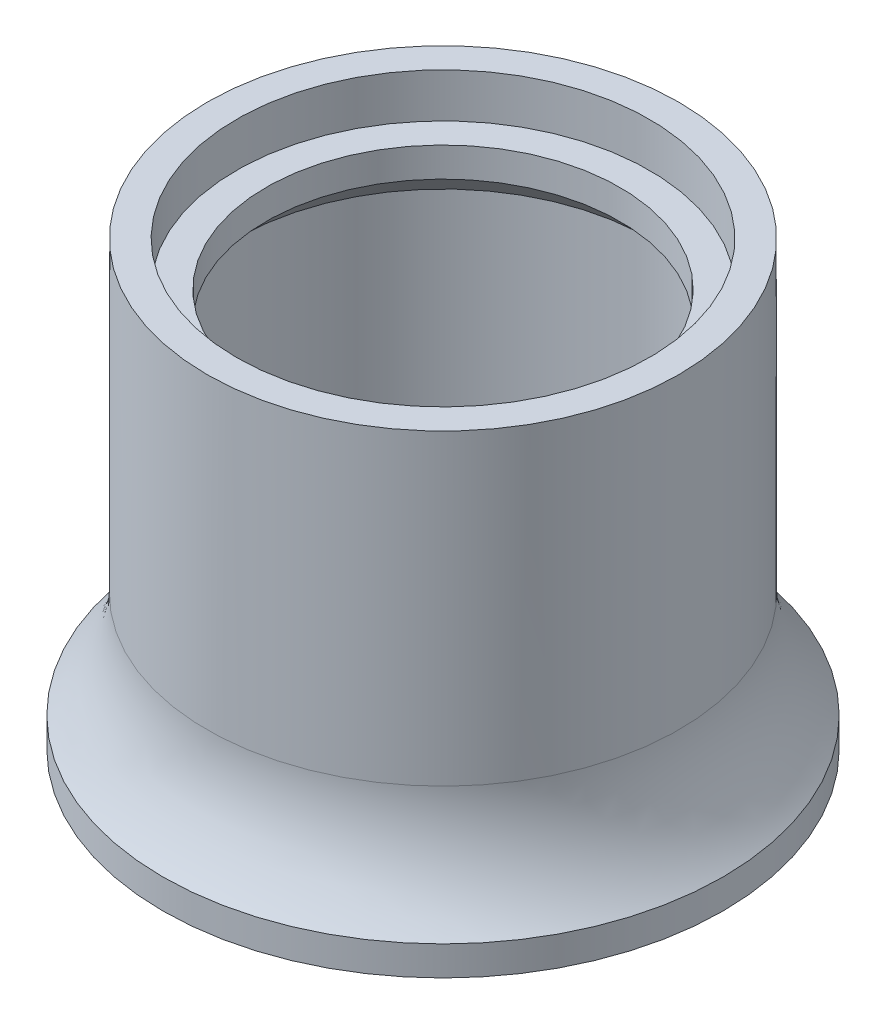
ISO-10303-21;
HEADER;
FILE_DESCRIPTION(('STEP AP214'),'2;1');
FILE_NAME('part.step','',(''),(''),'','','');
FILE_SCHEMA(('AUTOMOTIVE_DESIGN { 1 0 10303 214 1 1 1 1 }'));
ENDSEC;
DATA;
#1=APPLICATION_CONTEXT('core data for automotive mechanical design processes');
#2=APPLICATION_PROTOCOL_DEFINITION('international standard','automotive_design',2000,#1);
#3=PRODUCT_CONTEXT('',#1,'mechanical');
#4=PRODUCT('Part','Part','',(#3));
#5=PRODUCT_RELATED_PRODUCT_CATEGORY('part','',(#4));
#6=PRODUCT_DEFINITION_FORMATION('','',#4);
#7=PRODUCT_DEFINITION_CONTEXT('part definition',#1,'design');
#8=PRODUCT_DEFINITION('design','',#6,#7);
#9=PRODUCT_DEFINITION_SHAPE('','',#8);
#10=(LENGTH_UNIT() NAMED_UNIT(*) SI_UNIT(.MILLI.,.METRE.));
#11=(NAMED_UNIT(*) PLANE_ANGLE_UNIT() SI_UNIT($,.RADIAN.));
#12=(NAMED_UNIT(*) SI_UNIT($,.STERADIAN.) SOLID_ANGLE_UNIT());
#13=UNCERTAINTY_MEASURE_WITH_UNIT(LENGTH_MEASURE(1.E-05),#10,'distance_accuracy_value','');
#14=(GEOMETRIC_REPRESENTATION_CONTEXT(3) GLOBAL_UNCERTAINTY_ASSIGNED_CONTEXT((#13)) GLOBAL_UNIT_ASSIGNED_CONTEXT((#10,
#11,#12)) REPRESENTATION_CONTEXT('',''));
#15=CARTESIAN_POINT('',(0.,0.,0.));
#16=DIRECTION('',(0.,0.,1.));
#17=DIRECTION('',(1.,0.,0.));
#18=AXIS2_PLACEMENT_3D('',#15,#16,#17);
#19=CARTESIAN_POINT('',(0.,30.,0.));
#20=DIRECTION('',(0.,-1.,0.));
#21=DIRECTION('',(0.,0.,-1.));
#22=AXIS2_PLACEMENT_3D('',#19,#20,#21);
#23=CYLINDRICAL_SURFACE('',#22,16.);
#24=CARTESIAN_POINT('',(0.,9.14142842854285,0.));
#25=DIRECTION('',(0.,-1.,0.));
#26=DIRECTION('',(0.,0.,-1.));
#27=AXIS2_PLACEMENT_3D('',#24,#25,#26);
#28=CIRCLE('',#27,16.);
#29=CARTESIAN_POINT('',(0.,9.14142842854285,-16.));
#30=VERTEX_POINT('',#29);
#31=EDGE_CURVE('E10',#30,#30,#28,.F.);
#32=ORIENTED_EDGE('',*,*,#31,.T.);
#33=EDGE_LOOP('',(#32));
#34=FACE_BOUND('',#33,.T.);
#35=CARTESIAN_POINT('',(0.,30.,0.));
#36=DIRECTION('',(0.,1.,0.));
#37=DIRECTION('',(0.,0.,1.));
#38=AXIS2_PLACEMENT_3D('',#35,#36,#37);
#39=CIRCLE('',#38,16.);
#40=CARTESIAN_POINT('',(0.,30.,16.));
#41=VERTEX_POINT('',#40);
#42=EDGE_CURVE('E47',#41,#41,#39,.T.);
#43=ORIENTED_EDGE('',*,*,#42,.F.);
#44=EDGE_LOOP('',(#43));
#45=FACE_BOUND('',#44,.T.);
#46=ADVANCED_FACE('F32',(#34,#45),#23,.T.);
#47=CARTESIAN_POINT('',(0.,30.,0.));
#48=DIRECTION('',(0.,-1.,0.));
#49=DIRECTION('',(0.,0.,-1.));
#50=AXIS2_PLACEMENT_3D('',#47,#48,#49);
#51=CYLINDRICAL_SURFACE('',#50,14.);
#52=CARTESIAN_POINT('',(0.,23.,0.));
#53=DIRECTION('',(0.,1.,0.));
#54=DIRECTION('',(0.,0.,1.));
#55=AXIS2_PLACEMENT_3D('',#52,#53,#54);
#56=CIRCLE('',#55,14.);
#57=CARTESIAN_POINT('',(0.,23.,14.));
#58=VERTEX_POINT('',#57);
#59=EDGE_CURVE('E39',#58,#58,#56,.T.);
#60=ORIENTED_EDGE('',*,*,#59,.T.);
#61=EDGE_LOOP('',(#60));
#62=FACE_BOUND('',#61,.T.);
#63=CARTESIAN_POINT('',(0.,0.,0.));
#64=DIRECTION('',(0.,1.,0.));
#65=DIRECTION('',(0.,0.,1.));
#66=AXIS2_PLACEMENT_3D('',#63,#64,#65);
#67=CIRCLE('',#66,14.);
#68=CARTESIAN_POINT('',(0.,0.,14.));
#69=VERTEX_POINT('',#68);
#70=EDGE_CURVE('E53',#69,#69,#67,.T.);
#71=ORIENTED_EDGE('',*,*,#70,.F.);
#72=EDGE_LOOP('',(#71));
#73=FACE_BOUND('',#72,.T.);
#74=ADVANCED_FACE('F82',(#62,#73),#51,.F.);
#75=CARTESIAN_POINT('',(0.,30.,0.));
#76=DIRECTION('',(0.,1.,0.));
#77=DIRECTION('',(0.,0.,1.));
#78=AXIS2_PLACEMENT_3D('',#75,#76,#77);
#79=PLANE('',#78);
#80=ORIENTED_EDGE('',*,*,#42,.T.);
#81=EDGE_LOOP('',(#80));
#82=FACE_BOUND('',#81,.T.);
#83=CARTESIAN_POINT('',(0.,30.,0.));
#84=DIRECTION('',(0.,1.,0.));
#85=DIRECTION('',(0.,0.,1.));
#86=AXIS2_PLACEMENT_3D('',#83,#84,#85);
#87=CIRCLE('',#86,14.);
#88=CARTESIAN_POINT('',(0.,30.,14.));
#89=VERTEX_POINT('',#88);
#90=EDGE_CURVE('E52',#89,#89,#87,.T.);
#91=ORIENTED_EDGE('',*,*,#90,.F.);
#92=EDGE_LOOP('',(#91));
#93=FACE_BOUND('',#92,.T.);
#94=ADVANCED_FACE('F87',(#82,#93),#79,.T.);
#95=CARTESIAN_POINT('',(0.,0.,0.));
#96=DIRECTION('',(0.,1.,0.));
#97=DIRECTION('',(0.,0.,1.));
#98=AXIS2_PLACEMENT_3D('',#95,#96,#97);
#99=PLANE('',#98);
#100=ORIENTED_EDGE('',*,*,#70,.T.);
#101=EDGE_LOOP('',(#100));
#102=FACE_BOUND('',#101,.T.);
#103=CARTESIAN_POINT('',(0.,0.,0.));
#104=DIRECTION('',(0.,1.,0.));
#105=DIRECTION('',(0.,0.,1.));
#106=AXIS2_PLACEMENT_3D('',#103,#104,#105);
#107=CIRCLE('',#106,19.);
#108=CARTESIAN_POINT('',(0.,0.,19.));
#109=VERTEX_POINT('',#108);
#110=EDGE_CURVE('E65',#109,#109,#107,.T.);
#111=ORIENTED_EDGE('',*,*,#110,.F.);
#112=EDGE_LOOP('',(#111));
#113=FACE_BOUND('',#112,.T.);
#114=ADVANCED_FACE('F92',(#102,#113),#99,.F.);
#115=CARTESIAN_POINT('',(0.,27.,0.));
#116=DIRECTION('',(0.,1.,0.));
#117=DIRECTION('',(0.,0.,1.));
#118=AXIS2_PLACEMENT_3D('',#115,#116,#117);
#119=CIRCLE('',#118,14.);
#120=CARTESIAN_POINT('',(0.,27.,14.));
#121=VERTEX_POINT('',#120);
#122=EDGE_CURVE('E43',#121,#121,#119,.T.);
#123=ORIENTED_EDGE('',*,*,#122,.F.);
#124=EDGE_LOOP('',(#123));
#125=FACE_BOUND('',#124,.T.);
#126=ORIENTED_EDGE('',*,*,#90,.T.);
#127=EDGE_LOOP('',(#126));
#128=FACE_BOUND('',#127,.T.);
#129=ADVANCED_FACE('F89',(#125,#128),#51,.F.);
#130=CARTESIAN_POINT('',(0.,27.,0.));
#131=DIRECTION('',(0.,1.,0.));
#132=DIRECTION('',(0.,0.,1.));
#133=AXIS2_PLACEMENT_3D('',#130,#131,#132);
#134=PLANE('',#133);
#135=CARTESIAN_POINT('',(0.,27.,0.));
#136=DIRECTION('',(0.,1.,0.));
#137=DIRECTION('',(0.,0.,1.));
#138=AXIS2_PLACEMENT_3D('',#135,#136,#137);
#139=CIRCLE('',#138,12.);
#140=CARTESIAN_POINT('',(0.,27.,12.));
#141=VERTEX_POINT('',#140);
#142=EDGE_CURVE('E59',#141,#141,#139,.T.);
#143=ORIENTED_EDGE('',*,*,#142,.F.);
#144=EDGE_LOOP('',(#143));
#145=FACE_BOUND('',#144,.T.);
#146=ORIENTED_EDGE('',*,*,#122,.T.);
#147=EDGE_LOOP('',(#146));
#148=FACE_BOUND('',#147,.T.);
#149=ADVANCED_FACE('F100',(#145,#148),#134,.T.);
#150=CARTESIAN_POINT('',(0.,25.,0.));
#151=DIRECTION('',(0.,1.,0.));
#152=DIRECTION('',(0.,0.,1.));
#153=AXIS2_PLACEMENT_3D('',#150,#151,#152);
#154=CYLINDRICAL_SURFACE('',#153,12.);
#155=CARTESIAN_POINT('',(0.,25.,0.));
#156=DIRECTION('',(0.,1.,0.));
#157=DIRECTION('',(0.,0.,1.));
#158=AXIS2_PLACEMENT_3D('',#155,#156,#157);
#159=CIRCLE('',#158,12.);
#160=CARTESIAN_POINT('',(0.,25.,12.));
#161=VERTEX_POINT('',#160);
#162=EDGE_CURVE('E56',#161,#161,#159,.T.);
#163=ORIENTED_EDGE('',*,*,#162,.F.);
#164=EDGE_LOOP('',(#163));
#165=FACE_BOUND('',#164,.T.);
#166=ORIENTED_EDGE('',*,*,#142,.T.);
#167=EDGE_LOOP('',(#166));
#168=FACE_BOUND('',#167,.T.);
#169=ADVANCED_FACE('F95',(#165,#168),#154,.F.);
#170=CARTESIAN_POINT('',(0.,23.,0.));
#171=DIRECTION('',(0.,-1.,0.));
#172=DIRECTION('',(0.,0.,-1.));
#173=AXIS2_PLACEMENT_3D('',#170,#171,#172);
#174=CONICAL_SURFACE('',#173,14.,0.785398163397446);
#175=ORIENTED_EDGE('',*,*,#162,.T.);
#176=EDGE_LOOP('',(#175));
#177=FACE_BOUND('',#176,.T.);
#178=ORIENTED_EDGE('',*,*,#59,.F.);
#179=EDGE_LOOP('',(#178));
#180=FACE_BOUND('',#179,.T.);
#181=ADVANCED_FACE('F78',(#177,#180),#174,.F.);
#182=CARTESIAN_POINT('',(0.,-53.7401153701776,0.));
#183=DIRECTION('',(0.,1.,0.));
#184=DIRECTION('',(0.,0.,1.));
#185=AXIS2_PLACEMENT_3D('',#182,#183,#184);
#186=CYLINDRICAL_SURFACE('',#185,19.);
#187=CARTESIAN_POINT('',(0.,2.,0.));
#188=DIRECTION('',(0.,-1.,0.));
#189=DIRECTION('',(0.,0.,-1.));
#190=AXIS2_PLACEMENT_3D('',#187,#188,#189);
#191=CIRCLE('',#190,19.);
#192=CARTESIAN_POINT('',(0.,1.99999999999999,19.));
#193=VERTEX_POINT('',#192);
#194=EDGE_CURVE('E62',#193,#193,#191,.T.);
#195=CARTESIAN_POINT('',(0.,0.,19.));
#196=CARTESIAN_POINT('',(0.,0.0208333333333264,19.));
#197=CARTESIAN_POINT('',(0.,0.0416666666666598,19.));
#198=CARTESIAN_POINT('',(0.,0.0833333333333265,19.));
#199=CARTESIAN_POINT('',(0.,0.10416666666666,19.));
#200=CARTESIAN_POINT('',(0.,0.145833333333327,19.));
#201=CARTESIAN_POINT('',(0.,0.16666666666666,19.));
#202=CARTESIAN_POINT('',(0.,0.208333333333327,19.));
#203=CARTESIAN_POINT('',(0.,0.22916666666666,19.));
#204=CARTESIAN_POINT('',(0.,0.270833333333327,19.));
#205=CARTESIAN_POINT('',(0.,0.29166666666666,19.));
#206=CARTESIAN_POINT('',(0.,0.333333333333327,19.));
#207=CARTESIAN_POINT('',(0.,0.35416666666666,19.));
#208=CARTESIAN_POINT('',(0.,0.395833333333327,19.));
#209=CARTESIAN_POINT('',(0.,0.41666666666666,19.));
#210=CARTESIAN_POINT('',(0.,0.458333333333327,19.));
#211=CARTESIAN_POINT('',(0.,0.47916666666666,19.));
#212=CARTESIAN_POINT('',(0.,0.520833333333327,19.));
#213=CARTESIAN_POINT('',(0.,0.54166666666666,19.));
#214=CARTESIAN_POINT('',(0.,0.583333333333327,19.));
#215=CARTESIAN_POINT('',(0.,0.60416666666666,19.));
#216=CARTESIAN_POINT('',(0.,0.645833333333327,19.));
#217=CARTESIAN_POINT('',(0.,0.66666666666666,19.));
#218=CARTESIAN_POINT('',(0.,0.708333333333327,19.));
#219=CARTESIAN_POINT('',(0.,0.72916666666666,19.));
#220=CARTESIAN_POINT('',(0.,0.770833333333327,19.));
#221=CARTESIAN_POINT('',(0.,0.79166666666666,19.));
#222=CARTESIAN_POINT('',(0.,0.833333333333327,19.));
#223=CARTESIAN_POINT('',(0.,0.854166666666661,19.));
#224=CARTESIAN_POINT('',(0.,0.895833333333327,19.));
#225=CARTESIAN_POINT('',(0.,0.916666666666661,19.));
#226=CARTESIAN_POINT('',(0.,0.958333333333327,19.));
#227=CARTESIAN_POINT('',(0.,0.979166666666661,19.));
#228=CARTESIAN_POINT('',(0.,1.02083333333333,19.));
#229=CARTESIAN_POINT('',(0.,1.04166666666666,19.));
#230=CARTESIAN_POINT('',(0.,1.08333333333333,19.));
#231=CARTESIAN_POINT('',(0.,1.10416666666666,19.));
#232=CARTESIAN_POINT('',(0.,1.14583333333333,19.));
#233=CARTESIAN_POINT('',(0.,1.16666666666666,19.));
#234=CARTESIAN_POINT('',(0.,1.20833333333333,19.));
#235=CARTESIAN_POINT('',(0.,1.22916666666666,19.));
#236=CARTESIAN_POINT('',(0.,1.27083333333333,19.));
#237=CARTESIAN_POINT('',(0.,1.29166666666666,19.));
#238=CARTESIAN_POINT('',(0.,1.33333333333333,19.));
#239=CARTESIAN_POINT('',(0.,1.35416666666666,19.));
#240=CARTESIAN_POINT('',(0.,1.39583333333333,19.));
#241=CARTESIAN_POINT('',(0.,1.41666666666666,19.));
#242=CARTESIAN_POINT('',(0.,1.45833333333333,19.));
#243=CARTESIAN_POINT('',(0.,1.47916666666666,19.));
#244=CARTESIAN_POINT('',(0.,1.52083333333333,19.));
#245=CARTESIAN_POINT('',(0.,1.54166666666666,19.));
#246=CARTESIAN_POINT('',(0.,1.58333333333333,19.));
#247=CARTESIAN_POINT('',(0.,1.60416666666666,19.));
#248=CARTESIAN_POINT('',(0.,1.64583333333333,19.));
#249=CARTESIAN_POINT('',(0.,1.66666666666666,19.));
#250=CARTESIAN_POINT('',(0.,1.70833333333333,19.));
#251=CARTESIAN_POINT('',(0.,1.72916666666666,19.));
#252=CARTESIAN_POINT('',(0.,1.77083333333333,19.));
#253=CARTESIAN_POINT('',(0.,1.79166666666666,19.));
#254=CARTESIAN_POINT('',(0.,1.83333333333333,19.));
#255=CARTESIAN_POINT('',(0.,1.85416666666666,19.));
#256=CARTESIAN_POINT('',(0.,1.89583333333333,19.));
#257=CARTESIAN_POINT('',(0.,1.91666666666666,19.));
#258=CARTESIAN_POINT('',(0.,1.95833333333333,19.));
#259=CARTESIAN_POINT('',(0.,1.97916666666666,19.));
#260=CARTESIAN_POINT('',(0.,1.99999999999999,19.));
#261=B_SPLINE_CURVE_WITH_KNOTS('',3,(#195,#196,#197,#198,#199,#200,#201,#202,#203,#204,#205,
#206,#207,#208,#209,#210,#211,#212,#213,#214,#215,#216,#217,#218,#219,#220,#221,#222,#223,#224,
#225,#226,#227,#228,#229,#230,#231,#232,#233,#234,#235,#236,#237,#238,#239,#240,#241,#242,#243,
#244,#245,#246,#247,#248,#249,#250,#251,#252,#253,#254,#255,#256,#257,#258,#259,#260),
.UNSPECIFIED.,.F.,.F.,(4,2,2,2,2,2,2,2,2,2,2,2,2,2,2,2,2,2,2,2,2,2,2,2,2,2,2,2,2,2,2,2,4),(0.,
0.0625000000000001,0.125,0.1875,0.25,0.3125,0.375,0.4375,0.5,0.5625,0.625000000000001,
0.687500000000001,0.750000000000001,0.812500000000001,0.875000000000001,0.937500000000001,1.,
1.0625,1.125,1.1875,1.25,1.3125,1.375,1.4375,1.5,1.5625,1.625,1.6875,1.75,1.8125,1.875,1.9375,
2.),.UNSPECIFIED.);
#262=EDGE_CURVE('BSEAM71',#109,#193,#261,.T.);
#263=ORIENTED_EDGE('',*,*,#110,.T.);
#264=ORIENTED_EDGE('',*,*,#194,.T.);
#265=ORIENTED_EDGE('',*,*,#262,.T.);
#266=ORIENTED_EDGE('',*,*,#262,.F.);
#267=EDGE_LOOP('',(#263,#265,#264,#266));
#268=FACE_BOUND('',#267,.T.);
#269=ADVANCED_FACE('F71',(#268),#186,.T.);
#270=CARTESIAN_POINT('',(0.,9.14142842854285,0.));
#271=DIRECTION('',(0.,-1.,0.));
#272=DIRECTION('',(0.,0.,-1.));
#273=AXIS2_PLACEMENT_3D('',#270,#271,#272);
#274=TOROIDAL_SURFACE('',#273,26.,10.);
#275=ORIENTED_EDGE('',*,*,#31,.F.);
#276=EDGE_LOOP('',(#275));
#277=FACE_BOUND('',#276,.T.);
#278=ORIENTED_EDGE('',*,*,#194,.F.);
#279=EDGE_LOOP('',(#278));
#280=FACE_BOUND('',#279,.T.);
#281=ADVANCED_FACE('F34',(#277,#280),#274,.F.);
#282=CLOSED_SHELL('',(#46,#74,#94,#114,#129,#149,#169,#181,#269,#281));
#283=MANIFOLD_SOLID_BREP('B2',#282);
#284=ADVANCED_BREP_SHAPE_REPRESENTATION('',(#18,#283),#14);
#285=SHAPE_DEFINITION_REPRESENTATION(#9,#284);
ENDSEC;
END-ISO-10303-21;
